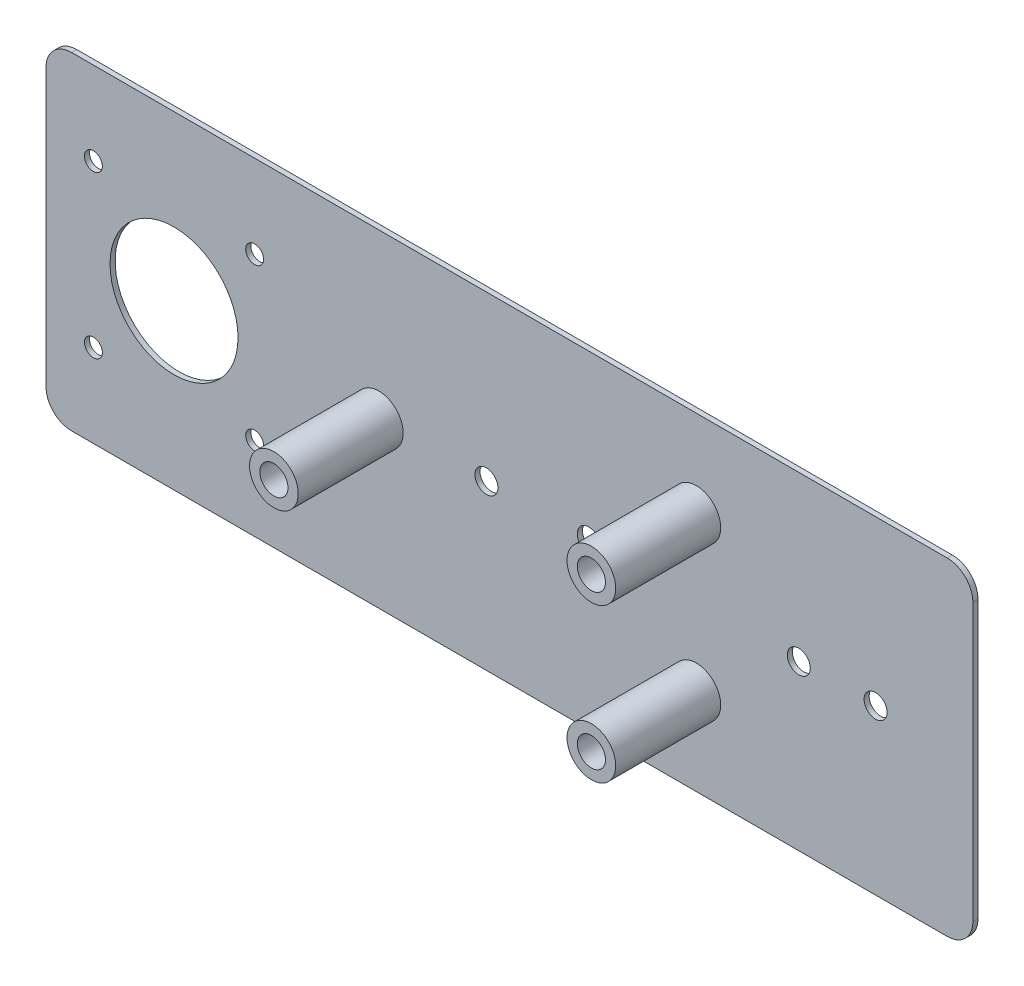
ISO-10303-21;
HEADER;
FILE_DESCRIPTION(('STEP AP214'),'2;1');
FILE_NAME('part.step','',(''),(''),'','','');
FILE_SCHEMA(('AUTOMOTIVE_DESIGN { 1 0 10303 214 1 1 1 1 }'));
ENDSEC;
DATA;
#1=APPLICATION_CONTEXT('core data for automotive mechanical design processes');
#2=APPLICATION_PROTOCOL_DEFINITION('international standard','automotive_design',2000,#1);
#3=PRODUCT_CONTEXT('',#1,'mechanical');
#4=PRODUCT('Part','Part','',(#3));
#5=PRODUCT_RELATED_PRODUCT_CATEGORY('part','',(#4));
#6=PRODUCT_DEFINITION_FORMATION('','',#4);
#7=PRODUCT_DEFINITION_CONTEXT('part definition',#1,'design');
#8=PRODUCT_DEFINITION('design','',#6,#7);
#9=PRODUCT_DEFINITION_SHAPE('','',#8);
#10=(LENGTH_UNIT() NAMED_UNIT(*) SI_UNIT(.MILLI.,.METRE.));
#11=(NAMED_UNIT(*) PLANE_ANGLE_UNIT() SI_UNIT($,.RADIAN.));
#12=(NAMED_UNIT(*) SI_UNIT($,.STERADIAN.) SOLID_ANGLE_UNIT());
#13=UNCERTAINTY_MEASURE_WITH_UNIT(LENGTH_MEASURE(1.E-05),#10,'distance_accuracy_value','');
#14=(GEOMETRIC_REPRESENTATION_CONTEXT(3) GLOBAL_UNCERTAINTY_ASSIGNED_CONTEXT((#13)) GLOBAL_UNIT_ASSIGNED_CONTEXT((#10,
#11,#12)) REPRESENTATION_CONTEXT('',''));
#15=CARTESIAN_POINT('',(0.,0.,0.));
#16=DIRECTION('',(0.,0.,1.));
#17=DIRECTION('',(1.,0.,0.));
#18=AXIS2_PLACEMENT_3D('',#15,#16,#17);
#19=CARTESIAN_POINT('',(-85.5,27.,1.));
#20=DIRECTION('',(0.,0.,-1.));
#21=DIRECTION('',(-1.,0.,0.));
#22=AXIS2_PLACEMENT_3D('',#19,#20,#21);
#23=PLANE('',#22);
#24=CARTESIAN_POINT('',(-25.5,0.,1.));
#25=DIRECTION('',(0.,0.,-1.));
#26=DIRECTION('',(-1.,0.,0.));
#27=AXIS2_PLACEMENT_3D('',#24,#25,#26);
#28=CIRCLE('',#27,4.75);
#29=CARTESIAN_POINT('',(-30.25,0.,1.));
#30=VERTEX_POINT('',#29);
#31=EDGE_CURVE('E143',#30,#30,#28,.F.);
#32=ORIENTED_EDGE('',*,*,#31,.F.);
#33=EDGE_LOOP('',(#32));
#34=FACE_BOUND('',#33,.T.);
#35=CARTESIAN_POINT('',(36.5,-15.,1.));
#36=DIRECTION('',(0.,0.,-1.));
#37=DIRECTION('',(-1.,0.,0.));
#38=AXIS2_PLACEMENT_3D('',#35,#36,#37);
#39=CIRCLE('',#38,4.75000000000001);
#40=CARTESIAN_POINT('',(31.75,-15.,1.));
#41=VERTEX_POINT('',#40);
#42=EDGE_CURVE('E46',#41,#41,#39,.F.);
#43=ORIENTED_EDGE('',*,*,#42,.F.);
#44=EDGE_LOOP('',(#43));
#45=FACE_BOUND('',#44,.T.);
#46=CARTESIAN_POINT('',(36.5,15.,1.));
#47=DIRECTION('',(0.,0.,-1.));
#48=DIRECTION('',(-1.,0.,0.));
#49=AXIS2_PLACEMENT_3D('',#46,#47,#48);
#50=CIRCLE('',#49,4.75);
#51=CARTESIAN_POINT('',(31.75,15.,1.));
#52=VERTEX_POINT('',#51);
#53=EDGE_CURVE('E11',#52,#52,#50,.F.);
#54=ORIENTED_EDGE('',*,*,#53,.F.);
#55=EDGE_LOOP('',(#54));
#56=FACE_BOUND('',#55,.T.);
#57=CARTESIAN_POINT('',(-85.5,-27.,1.));
#58=DIRECTION('',(0.,0.,-1.));
#59=DIRECTION('',(-1.,0.,0.));
#60=AXIS2_PLACEMENT_3D('',#57,#58,#59);
#61=CIRCLE('',#60,5.);
#62=CARTESIAN_POINT('',(-85.5,-32.,1.));
#63=VERTEX_POINT('',#62);
#64=CARTESIAN_POINT('',(-90.5,-27.,1.));
#65=VERTEX_POINT('',#64);
#66=EDGE_CURVE('E116',#63,#65,#61,.T.);
#67=ORIENTED_EDGE('',*,*,#66,.F.);
#68=DIRECTION('',(1.,0.,0.));
#69=VECTOR('',#68,1.);
#70=CARTESIAN_POINT('',(-14.5,-32.,1.));
#71=LINE('',#70,#69);
#72=CARTESIAN_POINT('',(85.5,-32.,1.));
#73=VERTEX_POINT('',#72);
#74=EDGE_CURVE('E172',#63,#73,#71,.T.);
#75=ORIENTED_EDGE('',*,*,#74,.T.);
#76=CARTESIAN_POINT('',(85.5,-27.,1.));
#77=DIRECTION('',(0.,0.,-1.));
#78=DIRECTION('',(-1.,0.,0.));
#79=AXIS2_PLACEMENT_3D('',#76,#77,#78);
#80=CIRCLE('',#79,5.00000000000001);
#81=CARTESIAN_POINT('',(90.5,-27.,1.));
#82=VERTEX_POINT('',#81);
#83=EDGE_CURVE('E267',#82,#73,#80,.T.);
#84=ORIENTED_EDGE('',*,*,#83,.F.);
#85=DIRECTION('',(0.,1.,0.));
#86=VECTOR('',#85,1.);
#87=CARTESIAN_POINT('',(90.5,32.,1.));
#88=LINE('',#87,#86);
#89=CARTESIAN_POINT('',(90.5,27.,1.));
#90=VERTEX_POINT('',#89);
#91=EDGE_CURVE('E125',#82,#90,#88,.T.);
#92=ORIENTED_EDGE('',*,*,#91,.T.);
#93=CARTESIAN_POINT('',(85.5,27.,1.));
#94=DIRECTION('',(0.,0.,-1.));
#95=DIRECTION('',(-1.,0.,0.));
#96=AXIS2_PLACEMENT_3D('',#93,#94,#95);
#97=CIRCLE('',#96,5.);
#98=CARTESIAN_POINT('',(85.5,32.,1.));
#99=VERTEX_POINT('',#98);
#100=EDGE_CURVE('E115',#99,#90,#97,.T.);
#101=ORIENTED_EDGE('',*,*,#100,.F.);
#102=DIRECTION('',(-1.,0.,0.));
#103=VECTOR('',#102,1.);
#104=CARTESIAN_POINT('',(-14.5,32.,1.));
#105=LINE('',#104,#103);
#106=CARTESIAN_POINT('',(-85.5,32.,1.));
#107=VERTEX_POINT('',#106);
#108=EDGE_CURVE('E111',#99,#107,#105,.T.);
#109=ORIENTED_EDGE('',*,*,#108,.T.);
#110=CARTESIAN_POINT('',(-85.5,27.,1.));
#111=DIRECTION('',(0.,0.,-1.));
#112=DIRECTION('',(-1.,0.,0.));
#113=AXIS2_PLACEMENT_3D('',#110,#111,#112);
#114=CIRCLE('',#113,5.);
#115=CARTESIAN_POINT('',(-90.5,27.,1.));
#116=VERTEX_POINT('',#115);
#117=EDGE_CURVE('E104',#116,#107,#114,.T.);
#118=ORIENTED_EDGE('',*,*,#117,.F.);
#119=DIRECTION('',(0.,-1.,0.));
#120=VECTOR('',#119,1.);
#121=CARTESIAN_POINT('',(-90.5,32.,1.));
#122=LINE('',#121,#120);
#123=EDGE_CURVE('E108',#116,#65,#122,.T.);
#124=ORIENTED_EDGE('',*,*,#123,.T.);
#125=EDGE_LOOP('',(#67,#75,#84,#92,#101,#109,#118,#124));
#126=FACE_BOUND('',#125,.T.);
#127=CARTESIAN_POINT('',(-4.50000000000001,0.,1.));
#128=DIRECTION('',(0.,0.,-1.));
#129=DIRECTION('',(-1.,0.,0.));
#130=AXIS2_PLACEMENT_3D('',#127,#128,#129);
#131=CIRCLE('',#130,2.25);
#132=CARTESIAN_POINT('',(-6.75,0.,1.));
#133=VERTEX_POINT('',#132);
#134=EDGE_CURVE('E144',#133,#133,#131,.F.);
#135=ORIENTED_EDGE('',*,*,#134,.F.);
#136=EDGE_LOOP('',(#135));
#137=FACE_BOUND('',#136,.T.);
#138=CARTESIAN_POINT('',(15.5,0.,1.));
#139=DIRECTION('',(0.,0.,-1.));
#140=DIRECTION('',(-1.,0.,0.));
#141=AXIS2_PLACEMENT_3D('',#138,#139,#140);
#142=CIRCLE('',#141,2.25);
#143=CARTESIAN_POINT('',(13.25,0.,1.));
#144=VERTEX_POINT('',#143);
#145=EDGE_CURVE('E147',#144,#144,#142,.F.);
#146=ORIENTED_EDGE('',*,*,#145,.F.);
#147=EDGE_LOOP('',(#146));
#148=FACE_BOUND('',#147,.T.);
#149=CARTESIAN_POINT('',(-81.25,15.75,1.));
#150=DIRECTION('',(0.,0.,-1.));
#151=DIRECTION('',(-1.,0.,0.));
#152=AXIS2_PLACEMENT_3D('',#149,#150,#151);
#153=CIRCLE('',#152,1.75);
#154=CARTESIAN_POINT('',(-83.,15.75,1.));
#155=VERTEX_POINT('',#154);
#156=EDGE_CURVE('E201',#155,#155,#153,.F.);
#157=ORIENTED_EDGE('',*,*,#156,.F.);
#158=EDGE_LOOP('',(#157));
#159=FACE_BOUND('',#158,.T.);
#160=CARTESIAN_POINT('',(-49.75,-15.75,1.));
#161=DIRECTION('',(0.,0.,-1.));
#162=DIRECTION('',(-1.,0.,0.));
#163=AXIS2_PLACEMENT_3D('',#160,#161,#162);
#164=CIRCLE('',#163,1.75);
#165=CARTESIAN_POINT('',(-51.5,-15.75,1.));
#166=VERTEX_POINT('',#165);
#167=EDGE_CURVE('E195',#166,#166,#164,.F.);
#168=ORIENTED_EDGE('',*,*,#167,.F.);
#169=EDGE_LOOP('',(#168));
#170=FACE_BOUND('',#169,.T.);
#171=CARTESIAN_POINT('',(-49.75,15.75,1.));
#172=DIRECTION('',(0.,0.,-1.));
#173=DIRECTION('',(-1.,0.,0.));
#174=AXIS2_PLACEMENT_3D('',#171,#172,#173);
#175=CIRCLE('',#174,1.75);
#176=CARTESIAN_POINT('',(-51.5,15.75,1.));
#177=VERTEX_POINT('',#176);
#178=EDGE_CURVE('E189',#177,#177,#175,.F.);
#179=ORIENTED_EDGE('',*,*,#178,.F.);
#180=EDGE_LOOP('',(#179));
#181=FACE_BOUND('',#180,.T.);
#182=CARTESIAN_POINT('',(-81.25,-15.75,1.));
#183=DIRECTION('',(0.,0.,-1.));
#184=DIRECTION('',(-1.,0.,0.));
#185=AXIS2_PLACEMENT_3D('',#182,#183,#184);
#186=CIRCLE('',#185,1.75);
#187=CARTESIAN_POINT('',(-83.,-15.75,1.));
#188=VERTEX_POINT('',#187);
#189=EDGE_CURVE('E192',#188,#188,#186,.F.);
#190=ORIENTED_EDGE('',*,*,#189,.F.);
#191=EDGE_LOOP('',(#190));
#192=FACE_BOUND('',#191,.T.);
#193=CARTESIAN_POINT('',(-65.5,0.,1.));
#194=DIRECTION('',(0.,0.,-1.));
#195=DIRECTION('',(-1.,0.,0.));
#196=AXIS2_PLACEMENT_3D('',#193,#194,#195);
#197=CIRCLE('',#196,12.5);
#198=CARTESIAN_POINT('',(-78.,0.,1.));
#199=VERTEX_POINT('',#198);
#200=EDGE_CURVE('E198',#199,#199,#197,.F.);
#201=ORIENTED_EDGE('',*,*,#200,.F.);
#202=EDGE_LOOP('',(#201));
#203=FACE_BOUND('',#202,.T.);
#204=CARTESIAN_POINT('',(71.5,0.,1.));
#205=DIRECTION('',(0.,0.,-1.));
#206=DIRECTION('',(-1.,0.,0.));
#207=AXIS2_PLACEMENT_3D('',#204,#205,#206);
#208=CIRCLE('',#207,2.25);
#209=CARTESIAN_POINT('',(69.25,0.,1.));
#210=VERTEX_POINT('',#209);
#211=EDGE_CURVE('E183',#210,#210,#208,.F.);
#212=ORIENTED_EDGE('',*,*,#211,.F.);
#213=EDGE_LOOP('',(#212));
#214=FACE_BOUND('',#213,.T.);
#215=CARTESIAN_POINT('',(56.5,0.,1.));
#216=DIRECTION('',(0.,0.,-1.));
#217=DIRECTION('',(-1.,0.,0.));
#218=AXIS2_PLACEMENT_3D('',#215,#216,#217);
#219=CIRCLE('',#218,2.25);
#220=CARTESIAN_POINT('',(54.25,0.,1.));
#221=VERTEX_POINT('',#220);
#222=EDGE_CURVE('E186',#221,#221,#219,.F.);
#223=ORIENTED_EDGE('',*,*,#222,.F.);
#224=EDGE_LOOP('',(#223));
#225=FACE_BOUND('',#224,.T.);
#226=ADVANCED_FACE('F38',(#34,#45,#56,#126,#137,#148,#159,#170,#181,#192,#203,#214,#225),#23,.F.);
#227=CARTESIAN_POINT('',(85.5,-27.,37.));
#228=DIRECTION('',(0.,0.,-1.));
#229=DIRECTION('',(-1.,0.,0.));
#230=AXIS2_PLACEMENT_3D('',#227,#228,#229);
#231=CYLINDRICAL_SURFACE('',#230,5.00000000000001);
#232=DIRECTION('',(0.,0.,-1.));
#233=VECTOR('',#232,1.);
#234=CARTESIAN_POINT('',(90.5,-27.,37.));
#235=LINE('',#234,#233);
#236=CARTESIAN_POINT('',(90.5,-27.,0.));
#237=VERTEX_POINT('',#236);
#238=EDGE_CURVE('E141',#82,#237,#235,.T.);
#239=ORIENTED_EDGE('',*,*,#238,.F.);
#240=ORIENTED_EDGE('',*,*,#83,.T.);
#241=DIRECTION('',(0.,0.,-1.));
#242=VECTOR('',#241,1.);
#243=CARTESIAN_POINT('',(85.5,-32.,37.));
#244=LINE('',#243,#242);
#245=CARTESIAN_POINT('',(85.5,-32.,0.));
#246=VERTEX_POINT('',#245);
#247=EDGE_CURVE('E53',#73,#246,#244,.T.);
#248=ORIENTED_EDGE('',*,*,#247,.T.);
#249=CARTESIAN_POINT('',(85.5,-27.,0.));
#250=DIRECTION('',(0.,0.,1.));
#251=DIRECTION('',(1.,0.,0.));
#252=AXIS2_PLACEMENT_3D('',#249,#250,#251);
#253=CIRCLE('',#252,5.00000000000001);
#254=EDGE_CURVE('E240',#246,#237,#253,.T.);
#255=ORIENTED_EDGE('',*,*,#254,.T.);
#256=EDGE_LOOP('',(#239,#240,#248,#255));
#257=FACE_BOUND('',#256,.T.);
#258=ADVANCED_FACE('F40',(#257),#231,.T.);
#259=CARTESIAN_POINT('',(90.5,27.,37.));
#260=DIRECTION('',(-1.,0.,0.));
#261=DIRECTION('',(0.,-1.,0.));
#262=AXIS2_PLACEMENT_3D('',#259,#260,#261);
#263=PLANE('',#262);
#264=DIRECTION('',(0.,0.,-1.));
#265=VECTOR('',#264,1.);
#266=CARTESIAN_POINT('',(90.5,27.,37.));
#267=LINE('',#266,#265);
#268=CARTESIAN_POINT('',(90.5,27.,0.));
#269=VERTEX_POINT('',#268);
#270=EDGE_CURVE('E139',#90,#269,#267,.T.);
#271=ORIENTED_EDGE('',*,*,#270,.F.);
#272=ORIENTED_EDGE('',*,*,#91,.F.);
#273=ORIENTED_EDGE('',*,*,#238,.T.);
#274=DIRECTION('',(0.,1.,0.));
#275=VECTOR('',#274,1.);
#276=CARTESIAN_POINT('',(90.5,27.,0.));
#277=LINE('',#276,#275);
#278=EDGE_CURVE('E242',#237,#269,#277,.T.);
#279=ORIENTED_EDGE('',*,*,#278,.T.);
#280=EDGE_LOOP('',(#271,#272,#273,#279));
#281=FACE_BOUND('',#280,.T.);
#282=ADVANCED_FACE('F271',(#281),#263,.F.);
#283=CARTESIAN_POINT('',(85.5,27.,37.));
#284=DIRECTION('',(0.,0.,-1.));
#285=DIRECTION('',(-1.,0.,0.));
#286=AXIS2_PLACEMENT_3D('',#283,#284,#285);
#287=CYLINDRICAL_SURFACE('',#286,5.);
#288=DIRECTION('',(0.,0.,-1.));
#289=VECTOR('',#288,1.);
#290=CARTESIAN_POINT('',(85.5,32.,37.));
#291=LINE('',#290,#289);
#292=CARTESIAN_POINT('',(85.5,32.,0.));
#293=VERTEX_POINT('',#292);
#294=EDGE_CURVE('E133',#99,#293,#291,.T.);
#295=ORIENTED_EDGE('',*,*,#294,.F.);
#296=ORIENTED_EDGE('',*,*,#100,.T.);
#297=ORIENTED_EDGE('',*,*,#270,.T.);
#298=CARTESIAN_POINT('',(85.5,27.,0.));
#299=DIRECTION('',(0.,0.,1.));
#300=DIRECTION('',(-1.,0.,0.));
#301=AXIS2_PLACEMENT_3D('',#298,#299,#300);
#302=CIRCLE('',#301,5.);
#303=EDGE_CURVE('E245',#269,#293,#302,.T.);
#304=ORIENTED_EDGE('',*,*,#303,.T.);
#305=EDGE_LOOP('',(#295,#296,#297,#304));
#306=FACE_BOUND('',#305,.T.);
#307=ADVANCED_FACE('F372',(#306),#287,.T.);
#308=CARTESIAN_POINT('',(-85.5,32.,37.));
#309=DIRECTION('',(0.,-1.,0.));
#310=DIRECTION('',(0.,0.,-1.));
#311=AXIS2_PLACEMENT_3D('',#308,#309,#310);
#312=PLANE('',#311);
#313=DIRECTION('',(0.,0.,-1.));
#314=VECTOR('',#313,1.);
#315=CARTESIAN_POINT('',(-85.5,32.,37.));
#316=LINE('',#315,#314);
#317=CARTESIAN_POINT('',(-85.5,32.,0.));
#318=VERTEX_POINT('',#317);
#319=EDGE_CURVE('E131',#107,#318,#316,.T.);
#320=ORIENTED_EDGE('',*,*,#319,.F.);
#321=ORIENTED_EDGE('',*,*,#108,.F.);
#322=ORIENTED_EDGE('',*,*,#294,.T.);
#323=DIRECTION('',(-1.,0.,0.));
#324=VECTOR('',#323,1.);
#325=CARTESIAN_POINT('',(-85.5,32.,0.));
#326=LINE('',#325,#324);
#327=EDGE_CURVE('E248',#293,#318,#326,.T.);
#328=ORIENTED_EDGE('',*,*,#327,.T.);
#329=EDGE_LOOP('',(#320,#321,#322,#328));
#330=FACE_BOUND('',#329,.T.);
#331=ADVANCED_FACE('F369',(#330),#312,.F.);
#332=CARTESIAN_POINT('',(-85.5,27.,37.));
#333=DIRECTION('',(0.,0.,-1.));
#334=DIRECTION('',(-1.,0.,0.));
#335=AXIS2_PLACEMENT_3D('',#332,#333,#334);
#336=CYLINDRICAL_SURFACE('',#335,5.);
#337=DIRECTION('',(0.,0.,-1.));
#338=VECTOR('',#337,1.);
#339=CARTESIAN_POINT('',(-90.5,27.,37.));
#340=LINE('',#339,#338);
#341=CARTESIAN_POINT('',(-90.5,27.,0.));
#342=VERTEX_POINT('',#341);
#343=EDGE_CURVE('E122',#116,#342,#340,.T.);
#344=ORIENTED_EDGE('',*,*,#343,.F.);
#345=ORIENTED_EDGE('',*,*,#117,.T.);
#346=ORIENTED_EDGE('',*,*,#319,.T.);
#347=CARTESIAN_POINT('',(-85.5,27.,0.));
#348=DIRECTION('',(0.,0.,1.));
#349=DIRECTION('',(1.,0.,0.));
#350=AXIS2_PLACEMENT_3D('',#347,#348,#349);
#351=CIRCLE('',#350,5.);
#352=EDGE_CURVE('E129',#318,#342,#351,.T.);
#353=ORIENTED_EDGE('',*,*,#352,.T.);
#354=EDGE_LOOP('',(#344,#345,#346,#353));
#355=FACE_BOUND('',#354,.T.);
#356=ADVANCED_FACE('F127',(#355),#336,.T.);
#357=CARTESIAN_POINT('',(-90.5,27.,37.));
#358=DIRECTION('',(1.,0.,0.));
#359=DIRECTION('',(0.,1.,0.));
#360=AXIS2_PLACEMENT_3D('',#357,#358,#359);
#361=PLANE('',#360);
#362=DIRECTION('',(0.,0.,-1.));
#363=VECTOR('',#362,1.);
#364=CARTESIAN_POINT('',(-90.5,-27.,37.));
#365=LINE('',#364,#363);
#366=CARTESIAN_POINT('',(-90.5,-27.,0.));
#367=VERTEX_POINT('',#366);
#368=EDGE_CURVE('E124',#65,#367,#365,.T.);
#369=ORIENTED_EDGE('',*,*,#368,.F.);
#370=ORIENTED_EDGE('',*,*,#123,.F.);
#371=ORIENTED_EDGE('',*,*,#343,.T.);
#372=DIRECTION('',(0.,-1.,0.));
#373=VECTOR('',#372,1.);
#374=CARTESIAN_POINT('',(-90.5,27.,0.));
#375=LINE('',#374,#373);
#376=EDGE_CURVE('E252',#342,#367,#375,.T.);
#377=ORIENTED_EDGE('',*,*,#376,.T.);
#378=EDGE_LOOP('',(#369,#370,#371,#377));
#379=FACE_BOUND('',#378,.T.);
#380=ADVANCED_FACE('F120',(#379),#361,.F.);
#381=CARTESIAN_POINT('',(-85.5,-27.,37.));
#382=DIRECTION('',(0.,0.,-1.));
#383=DIRECTION('',(-1.,0.,0.));
#384=AXIS2_PLACEMENT_3D('',#381,#382,#383);
#385=CYLINDRICAL_SURFACE('',#384,5.);
#386=DIRECTION('',(0.,0.,-1.));
#387=VECTOR('',#386,1.);
#388=CARTESIAN_POINT('',(-85.5,-32.,37.));
#389=LINE('',#388,#387);
#390=CARTESIAN_POINT('',(-85.5,-32.,0.));
#391=VERTEX_POINT('',#390);
#392=EDGE_CURVE('E60',#63,#391,#389,.T.);
#393=ORIENTED_EDGE('',*,*,#392,.F.);
#394=ORIENTED_EDGE('',*,*,#66,.T.);
#395=ORIENTED_EDGE('',*,*,#368,.T.);
#396=CARTESIAN_POINT('',(-85.5,-27.,0.));
#397=DIRECTION('',(0.,0.,1.));
#398=DIRECTION('',(1.,0.,0.));
#399=AXIS2_PLACEMENT_3D('',#396,#397,#398);
#400=CIRCLE('',#399,5.);
#401=EDGE_CURVE('E254',#367,#391,#400,.T.);
#402=ORIENTED_EDGE('',*,*,#401,.T.);
#403=EDGE_LOOP('',(#393,#394,#395,#402));
#404=FACE_BOUND('',#403,.T.);
#405=ADVANCED_FACE('F361',(#404),#385,.T.);
#406=CARTESIAN_POINT('',(-85.5,-32.,37.));
#407=DIRECTION('',(0.,1.,0.));
#408=DIRECTION('',(0.,0.,1.));
#409=AXIS2_PLACEMENT_3D('',#406,#407,#408);
#410=PLANE('',#409);
#411=ORIENTED_EDGE('',*,*,#74,.F.);
#412=ORIENTED_EDGE('',*,*,#392,.T.);
#413=DIRECTION('',(1.,0.,0.));
#414=VECTOR('',#413,1.);
#415=CARTESIAN_POINT('',(-85.5,-32.,0.));
#416=LINE('',#415,#414);
#417=EDGE_CURVE('E256',#391,#246,#416,.T.);
#418=ORIENTED_EDGE('',*,*,#417,.T.);
#419=ORIENTED_EDGE('',*,*,#247,.F.);
#420=EDGE_LOOP('',(#411,#412,#418,#419));
#421=FACE_BOUND('',#420,.T.);
#422=ADVANCED_FACE('F260',(#421),#410,.F.);
#423=CARTESIAN_POINT('',(85.5,-27.,0.));
#424=DIRECTION('',(0.,0.,1.));
#425=DIRECTION('',(1.,0.,0.));
#426=AXIS2_PLACEMENT_3D('',#423,#424,#425);
#427=PLANE('',#426);
#428=CARTESIAN_POINT('',(-4.50000000000001,0.,0.));
#429=DIRECTION('',(0.,0.,1.));
#430=DIRECTION('',(1.,0.,0.));
#431=AXIS2_PLACEMENT_3D('',#428,#429,#430);
#432=CIRCLE('',#431,2.25);
#433=CARTESIAN_POINT('',(-2.25000000000001,0.,0.));
#434=VERTEX_POINT('',#433);
#435=EDGE_CURVE('E205',#434,#434,#432,.T.);
#436=ORIENTED_EDGE('',*,*,#435,.T.);
#437=EDGE_LOOP('',(#436));
#438=FACE_BOUND('',#437,.T.);
#439=CARTESIAN_POINT('',(15.5,0.,0.));
#440=DIRECTION('',(0.,0.,1.));
#441=DIRECTION('',(1.,0.,0.));
#442=AXIS2_PLACEMENT_3D('',#439,#440,#441);
#443=CIRCLE('',#442,2.25);
#444=CARTESIAN_POINT('',(17.75,0.,0.));
#445=VERTEX_POINT('',#444);
#446=EDGE_CURVE('E204',#445,#445,#443,.T.);
#447=ORIENTED_EDGE('',*,*,#446,.T.);
#448=EDGE_LOOP('',(#447));
#449=FACE_BOUND('',#448,.T.);
#450=CARTESIAN_POINT('',(71.5,0.,0.));
#451=DIRECTION('',(0.,0.,1.));
#452=DIRECTION('',(1.,0.,0.));
#453=AXIS2_PLACEMENT_3D('',#450,#451,#452);
#454=CIRCLE('',#453,2.25);
#455=CARTESIAN_POINT('',(73.75,0.,0.));
#456=VERTEX_POINT('',#455);
#457=EDGE_CURVE('E208',#456,#456,#454,.T.);
#458=ORIENTED_EDGE('',*,*,#457,.T.);
#459=EDGE_LOOP('',(#458));
#460=FACE_BOUND('',#459,.T.);
#461=CARTESIAN_POINT('',(36.5,15.,0.));
#462=DIRECTION('',(0.,0.,1.));
#463=DIRECTION('',(1.,0.,0.));
#464=AXIS2_PLACEMENT_3D('',#461,#462,#463);
#465=CIRCLE('',#464,2.75);
#466=CARTESIAN_POINT('',(39.25,15.,0.));
#467=VERTEX_POINT('',#466);
#468=EDGE_CURVE('E218',#467,#467,#465,.T.);
#469=ORIENTED_EDGE('',*,*,#468,.T.);
#470=EDGE_LOOP('',(#469));
#471=FACE_BOUND('',#470,.T.);
#472=CARTESIAN_POINT('',(36.5,-15.,0.));
#473=DIRECTION('',(0.,0.,1.));
#474=DIRECTION('',(1.,0.,0.));
#475=AXIS2_PLACEMENT_3D('',#472,#473,#474);
#476=CIRCLE('',#475,2.75);
#477=CARTESIAN_POINT('',(39.25,-15.,0.));
#478=VERTEX_POINT('',#477);
#479=EDGE_CURVE('E228',#478,#478,#476,.T.);
#480=ORIENTED_EDGE('',*,*,#479,.T.);
#481=EDGE_LOOP('',(#480));
#482=FACE_BOUND('',#481,.T.);
#483=CARTESIAN_POINT('',(56.5,0.,0.));
#484=DIRECTION('',(0.,0.,1.));
#485=DIRECTION('',(1.,0.,0.));
#486=AXIS2_PLACEMENT_3D('',#483,#484,#485);
#487=CIRCLE('',#486,2.25);
#488=CARTESIAN_POINT('',(58.75,0.,0.));
#489=VERTEX_POINT('',#488);
#490=EDGE_CURVE('E225',#489,#489,#487,.T.);
#491=ORIENTED_EDGE('',*,*,#490,.T.);
#492=EDGE_LOOP('',(#491));
#493=FACE_BOUND('',#492,.T.);
#494=CARTESIAN_POINT('',(-25.5,0.,0.));
#495=DIRECTION('',(0.,0.,1.));
#496=DIRECTION('',(1.,0.,0.));
#497=AXIS2_PLACEMENT_3D('',#494,#495,#496);
#498=CIRCLE('',#497,2.75);
#499=CARTESIAN_POINT('',(-22.75,0.,0.));
#500=VERTEX_POINT('',#499);
#501=EDGE_CURVE('E229',#500,#500,#498,.T.);
#502=ORIENTED_EDGE('',*,*,#501,.T.);
#503=EDGE_LOOP('',(#502));
#504=FACE_BOUND('',#503,.T.);
#505=CARTESIAN_POINT('',(-49.75,15.75,0.));
#506=DIRECTION('',(0.,0.,1.));
#507=DIRECTION('',(1.,0.,0.));
#508=AXIS2_PLACEMENT_3D('',#505,#506,#507);
#509=CIRCLE('',#508,1.75);
#510=CARTESIAN_POINT('',(-48.,15.75,0.));
#511=VERTEX_POINT('',#510);
#512=EDGE_CURVE('E219',#511,#511,#509,.T.);
#513=ORIENTED_EDGE('',*,*,#512,.T.);
#514=EDGE_LOOP('',(#513));
#515=FACE_BOUND('',#514,.T.);
#516=CARTESIAN_POINT('',(-81.25,-15.75,0.));
#517=DIRECTION('',(0.,0.,1.));
#518=DIRECTION('',(1.,0.,0.));
#519=AXIS2_PLACEMENT_3D('',#516,#517,#518);
#520=CIRCLE('',#519,1.75);
#521=CARTESIAN_POINT('',(-79.5,-15.75,0.));
#522=VERTEX_POINT('',#521);
#523=EDGE_CURVE('E214',#522,#522,#520,.T.);
#524=ORIENTED_EDGE('',*,*,#523,.T.);
#525=EDGE_LOOP('',(#524));
#526=FACE_BOUND('',#525,.T.);
#527=CARTESIAN_POINT('',(-49.75,-15.75,0.));
#528=DIRECTION('',(0.,0.,1.));
#529=DIRECTION('',(1.,0.,0.));
#530=AXIS2_PLACEMENT_3D('',#527,#528,#529);
#531=CIRCLE('',#530,1.75);
#532=CARTESIAN_POINT('',(-48.,-15.75,0.));
#533=VERTEX_POINT('',#532);
#534=EDGE_CURVE('E211',#533,#533,#531,.T.);
#535=ORIENTED_EDGE('',*,*,#534,.T.);
#536=EDGE_LOOP('',(#535));
#537=FACE_BOUND('',#536,.T.);
#538=CARTESIAN_POINT('',(-65.5,0.,0.));
#539=DIRECTION('',(0.,0.,1.));
#540=DIRECTION('',(1.,0.,0.));
#541=AXIS2_PLACEMENT_3D('',#538,#539,#540);
#542=CIRCLE('',#541,12.5);
#543=CARTESIAN_POINT('',(-53.,0.,0.));
#544=VERTEX_POINT('',#543);
#545=EDGE_CURVE('E215',#544,#544,#542,.T.);
#546=ORIENTED_EDGE('',*,*,#545,.T.);
#547=EDGE_LOOP('',(#546));
#548=FACE_BOUND('',#547,.T.);
#549=CARTESIAN_POINT('',(-81.25,15.75,0.));
#550=DIRECTION('',(0.,0.,1.));
#551=DIRECTION('',(1.,0.,0.));
#552=AXIS2_PLACEMENT_3D('',#549,#550,#551);
#553=CIRCLE('',#552,1.75);
#554=CARTESIAN_POINT('',(-79.5,15.75,0.));
#555=VERTEX_POINT('',#554);
#556=EDGE_CURVE('E222',#555,#555,#553,.T.);
#557=ORIENTED_EDGE('',*,*,#556,.T.);
#558=EDGE_LOOP('',(#557));
#559=FACE_BOUND('',#558,.T.);
#560=ORIENTED_EDGE('',*,*,#254,.F.);
#561=ORIENTED_EDGE('',*,*,#417,.F.);
#562=ORIENTED_EDGE('',*,*,#401,.F.);
#563=ORIENTED_EDGE('',*,*,#376,.F.);
#564=ORIENTED_EDGE('',*,*,#352,.F.);
#565=ORIENTED_EDGE('',*,*,#327,.F.);
#566=ORIENTED_EDGE('',*,*,#303,.F.);
#567=ORIENTED_EDGE('',*,*,#278,.F.);
#568=EDGE_LOOP('',(#560,#561,#562,#563,#564,#565,#566,#567));
#569=FACE_BOUND('',#568,.T.);
#570=ADVANCED_FACE('F264',(#438,#449,#460,#471,#482,#493,#504,#515,#526,#537,#548,#559,#569),
#427,.F.);
#571=CARTESIAN_POINT('',(-81.25,15.75,0.));
#572=DIRECTION('',(0.,0.,1.));
#573=DIRECTION('',(1.,0.,0.));
#574=AXIS2_PLACEMENT_3D('',#571,#572,#573);
#575=CYLINDRICAL_SURFACE('',#574,1.75);
#576=ORIENTED_EDGE('',*,*,#156,.T.);
#577=EDGE_LOOP('',(#576));
#578=FACE_BOUND('',#577,.T.);
#579=ORIENTED_EDGE('',*,*,#556,.F.);
#580=EDGE_LOOP('',(#579));
#581=FACE_BOUND('',#580,.T.);
#582=ADVANCED_FACE('F326',(#578,#581),#575,.F.);
#583=CARTESIAN_POINT('',(-65.5,0.,0.));
#584=DIRECTION('',(0.,0.,1.));
#585=DIRECTION('',(1.,0.,0.));
#586=AXIS2_PLACEMENT_3D('',#583,#584,#585);
#587=CYLINDRICAL_SURFACE('',#586,12.5);
#588=ORIENTED_EDGE('',*,*,#200,.T.);
#589=EDGE_LOOP('',(#588));
#590=FACE_BOUND('',#589,.T.);
#591=ORIENTED_EDGE('',*,*,#545,.F.);
#592=EDGE_LOOP('',(#591));
#593=FACE_BOUND('',#592,.T.);
#594=ADVANCED_FACE('F322',(#590,#593),#587,.F.);
#595=CARTESIAN_POINT('',(-49.75,-15.75,0.));
#596=DIRECTION('',(0.,0.,1.));
#597=DIRECTION('',(1.,0.,0.));
#598=AXIS2_PLACEMENT_3D('',#595,#596,#597);
#599=CYLINDRICAL_SURFACE('',#598,1.75);
#600=ORIENTED_EDGE('',*,*,#167,.T.);
#601=EDGE_LOOP('',(#600));
#602=FACE_BOUND('',#601,.T.);
#603=ORIENTED_EDGE('',*,*,#534,.F.);
#604=EDGE_LOOP('',(#603));
#605=FACE_BOUND('',#604,.T.);
#606=ADVANCED_FACE('F318',(#602,#605),#599,.F.);
#607=CARTESIAN_POINT('',(-81.25,-15.75,0.));
#608=DIRECTION('',(0.,0.,1.));
#609=DIRECTION('',(1.,0.,0.));
#610=AXIS2_PLACEMENT_3D('',#607,#608,#609);
#611=CYLINDRICAL_SURFACE('',#610,1.75);
#612=ORIENTED_EDGE('',*,*,#189,.T.);
#613=EDGE_LOOP('',(#612));
#614=FACE_BOUND('',#613,.T.);
#615=ORIENTED_EDGE('',*,*,#523,.F.);
#616=EDGE_LOOP('',(#615));
#617=FACE_BOUND('',#616,.T.);
#618=ADVANCED_FACE('F321',(#614,#617),#611,.F.);
#619=CARTESIAN_POINT('',(-49.75,15.75,0.));
#620=DIRECTION('',(0.,0.,1.));
#621=DIRECTION('',(1.,0.,0.));
#622=AXIS2_PLACEMENT_3D('',#619,#620,#621);
#623=CYLINDRICAL_SURFACE('',#622,1.75);
#624=ORIENTED_EDGE('',*,*,#178,.T.);
#625=EDGE_LOOP('',(#624));
#626=FACE_BOUND('',#625,.T.);
#627=ORIENTED_EDGE('',*,*,#512,.F.);
#628=EDGE_LOOP('',(#627));
#629=FACE_BOUND('',#628,.T.);
#630=ADVANCED_FACE('F328',(#626,#629),#623,.F.);
#631=CARTESIAN_POINT('',(-25.5,0.,0.));
#632=DIRECTION('',(0.,0.,1.));
#633=DIRECTION('',(1.,0.,0.));
#634=AXIS2_PLACEMENT_3D('',#631,#632,#633);
#635=CYLINDRICAL_SURFACE('',#634,2.75);
#636=ORIENTED_EDGE('',*,*,#501,.F.);
#637=EDGE_LOOP('',(#636));
#638=FACE_BOUND('',#637,.T.);
#639=CARTESIAN_POINT('',(-25.5,0.,21.5));
#640=DIRECTION('',(0.,0.,1.));
#641=DIRECTION('',(1.,0.,0.));
#642=AXIS2_PLACEMENT_3D('',#639,#640,#641);
#643=CIRCLE('',#642,2.75);
#644=CARTESIAN_POINT('',(-22.75,0.,21.5));
#645=VERTEX_POINT('',#644);
#646=EDGE_CURVE('E282',#645,#645,#643,.T.);
#647=ORIENTED_EDGE('',*,*,#646,.T.);
#648=EDGE_LOOP('',(#647));
#649=FACE_BOUND('',#648,.T.);
#650=ADVANCED_FACE('F331',(#638,#649),#635,.F.);
#651=CARTESIAN_POINT('',(56.5,0.,0.));
#652=DIRECTION('',(0.,0.,1.));
#653=DIRECTION('',(1.,0.,0.));
#654=AXIS2_PLACEMENT_3D('',#651,#652,#653);
#655=CYLINDRICAL_SURFACE('',#654,2.25);
#656=ORIENTED_EDGE('',*,*,#222,.T.);
#657=EDGE_LOOP('',(#656));
#658=FACE_BOUND('',#657,.T.);
#659=ORIENTED_EDGE('',*,*,#490,.F.);
#660=EDGE_LOOP('',(#659));
#661=FACE_BOUND('',#660,.T.);
#662=ADVANCED_FACE('F336',(#658,#661),#655,.F.);
#663=CARTESIAN_POINT('',(36.5,-15.,0.));
#664=DIRECTION('',(0.,0.,1.));
#665=DIRECTION('',(1.,0.,0.));
#666=AXIS2_PLACEMENT_3D('',#663,#664,#665);
#667=CYLINDRICAL_SURFACE('',#666,2.75);
#668=ORIENTED_EDGE('',*,*,#479,.F.);
#669=EDGE_LOOP('',(#668));
#670=FACE_BOUND('',#669,.T.);
#671=CARTESIAN_POINT('',(36.5,-15.,21.5));
#672=DIRECTION('',(0.,0.,1.));
#673=DIRECTION('',(1.,0.,0.));
#674=AXIS2_PLACEMENT_3D('',#671,#672,#673);
#675=CIRCLE('',#674,2.75);
#676=CARTESIAN_POINT('',(39.25,-15.,21.5));
#677=VERTEX_POINT('',#676);
#678=EDGE_CURVE('E279',#677,#677,#675,.T.);
#679=ORIENTED_EDGE('',*,*,#678,.T.);
#680=EDGE_LOOP('',(#679));
#681=FACE_BOUND('',#680,.T.);
#682=ADVANCED_FACE('F339',(#670,#681),#667,.F.);
#683=CARTESIAN_POINT('',(36.5,15.,0.));
#684=DIRECTION('',(0.,0.,1.));
#685=DIRECTION('',(1.,0.,0.));
#686=AXIS2_PLACEMENT_3D('',#683,#684,#685);
#687=CYLINDRICAL_SURFACE('',#686,2.75);
#688=ORIENTED_EDGE('',*,*,#468,.F.);
#689=EDGE_LOOP('',(#688));
#690=FACE_BOUND('',#689,.T.);
#691=CARTESIAN_POINT('',(36.5,15.,21.5));
#692=DIRECTION('',(0.,0.,1.));
#693=DIRECTION('',(1.,0.,0.));
#694=AXIS2_PLACEMENT_3D('',#691,#692,#693);
#695=CIRCLE('',#694,2.75);
#696=CARTESIAN_POINT('',(39.25,15.,21.5));
#697=VERTEX_POINT('',#696);
#698=EDGE_CURVE('E278',#697,#697,#695,.T.);
#699=ORIENTED_EDGE('',*,*,#698,.T.);
#700=EDGE_LOOP('',(#699));
#701=FACE_BOUND('',#700,.T.);
#702=ADVANCED_FACE('F288',(#690,#701),#687,.F.);
#703=CARTESIAN_POINT('',(71.5,0.,0.));
#704=DIRECTION('',(0.,0.,1.));
#705=DIRECTION('',(1.,0.,0.));
#706=AXIS2_PLACEMENT_3D('',#703,#704,#705);
#707=CYLINDRICAL_SURFACE('',#706,2.25);
#708=ORIENTED_EDGE('',*,*,#211,.T.);
#709=EDGE_LOOP('',(#708));
#710=FACE_BOUND('',#709,.T.);
#711=ORIENTED_EDGE('',*,*,#457,.F.);
#712=EDGE_LOOP('',(#711));
#713=FACE_BOUND('',#712,.T.);
#714=ADVANCED_FACE('F316',(#710,#713),#707,.F.);
#715=CARTESIAN_POINT('',(15.5,0.,0.));
#716=DIRECTION('',(0.,0.,1.));
#717=DIRECTION('',(1.,0.,0.));
#718=AXIS2_PLACEMENT_3D('',#715,#716,#717);
#719=CYLINDRICAL_SURFACE('',#718,2.25);
#720=ORIENTED_EDGE('',*,*,#145,.T.);
#721=EDGE_LOOP('',(#720));
#722=FACE_BOUND('',#721,.T.);
#723=ORIENTED_EDGE('',*,*,#446,.F.);
#724=EDGE_LOOP('',(#723));
#725=FACE_BOUND('',#724,.T.);
#726=ADVANCED_FACE('F312',(#722,#725),#719,.F.);
#727=CARTESIAN_POINT('',(-4.50000000000001,0.,0.));
#728=DIRECTION('',(0.,0.,1.));
#729=DIRECTION('',(1.,0.,0.));
#730=AXIS2_PLACEMENT_3D('',#727,#728,#729);
#731=CYLINDRICAL_SURFACE('',#730,2.25);
#732=ORIENTED_EDGE('',*,*,#134,.T.);
#733=EDGE_LOOP('',(#732));
#734=FACE_BOUND('',#733,.T.);
#735=ORIENTED_EDGE('',*,*,#435,.F.);
#736=EDGE_LOOP('',(#735));
#737=FACE_BOUND('',#736,.T.);
#738=ADVANCED_FACE('F305',(#734,#737),#731,.F.);
#739=CARTESIAN_POINT('',(-25.5,0.,21.5));
#740=DIRECTION('',(0.,0.,1.));
#741=DIRECTION('',(1.,0.,0.));
#742=AXIS2_PLACEMENT_3D('',#739,#740,#741);
#743=PLANE('',#742);
#744=ORIENTED_EDGE('',*,*,#646,.F.);
#745=EDGE_LOOP('',(#744));
#746=FACE_BOUND('',#745,.T.);
#747=CARTESIAN_POINT('',(-25.5,0.,21.5));
#748=DIRECTION('',(0.,0.,1.));
#749=DIRECTION('',(1.,0.,0.));
#750=AXIS2_PLACEMENT_3D('',#747,#748,#749);
#751=CIRCLE('',#750,4.75);
#752=CARTESIAN_POINT('',(-20.75,0.,21.5));
#753=VERTEX_POINT('',#752);
#754=EDGE_CURVE('E148',#753,#753,#751,.T.);
#755=ORIENTED_EDGE('',*,*,#754,.T.);
#756=EDGE_LOOP('',(#755));
#757=FACE_BOUND('',#756,.T.);
#758=ADVANCED_FACE('F302',(#746,#757),#743,.T.);
#759=CARTESIAN_POINT('',(-25.5,0.,21.5));
#760=DIRECTION('',(0.,0.,-1.));
#761=DIRECTION('',(-1.,0.,0.));
#762=AXIS2_PLACEMENT_3D('',#759,#760,#761);
#763=CYLINDRICAL_SURFACE('',#762,4.75);
#764=ORIENTED_EDGE('',*,*,#31,.T.);
#765=EDGE_LOOP('',(#764));
#766=FACE_BOUND('',#765,.T.);
#767=ORIENTED_EDGE('',*,*,#754,.F.);
#768=EDGE_LOOP('',(#767));
#769=FACE_BOUND('',#768,.T.);
#770=ADVANCED_FACE('F300',(#766,#769),#763,.T.);
#771=CARTESIAN_POINT('',(36.5,-15.,21.5));
#772=DIRECTION('',(0.,0.,1.));
#773=DIRECTION('',(1.,0.,0.));
#774=AXIS2_PLACEMENT_3D('',#771,#772,#773);
#775=PLANE('',#774);
#776=ORIENTED_EDGE('',*,*,#678,.F.);
#777=EDGE_LOOP('',(#776));
#778=FACE_BOUND('',#777,.T.);
#779=CARTESIAN_POINT('',(36.5,-15.,21.5));
#780=DIRECTION('',(0.,0.,1.));
#781=DIRECTION('',(1.,0.,0.));
#782=AXIS2_PLACEMENT_3D('',#779,#780,#781);
#783=CIRCLE('',#782,4.75000000000001);
#784=CARTESIAN_POINT('',(41.25,-15.,21.5));
#785=VERTEX_POINT('',#784);
#786=EDGE_CURVE('E171',#785,#785,#783,.T.);
#787=ORIENTED_EDGE('',*,*,#786,.T.);
#788=EDGE_LOOP('',(#787));
#789=FACE_BOUND('',#788,.T.);
#790=ADVANCED_FACE('F295',(#778,#789),#775,.T.);
#791=CARTESIAN_POINT('',(36.5,-15.,21.5));
#792=DIRECTION('',(0.,0.,-1.));
#793=DIRECTION('',(-1.,0.,0.));
#794=AXIS2_PLACEMENT_3D('',#791,#792,#793);
#795=CYLINDRICAL_SURFACE('',#794,4.75000000000001);
#796=ORIENTED_EDGE('',*,*,#42,.T.);
#797=EDGE_LOOP('',(#796));
#798=FACE_BOUND('',#797,.T.);
#799=ORIENTED_EDGE('',*,*,#786,.F.);
#800=EDGE_LOOP('',(#799));
#801=FACE_BOUND('',#800,.T.);
#802=ADVANCED_FACE('F153',(#798,#801),#795,.T.);
#803=CARTESIAN_POINT('',(36.5,15.,21.5));
#804=DIRECTION('',(0.,0.,1.));
#805=DIRECTION('',(1.,0.,0.));
#806=AXIS2_PLACEMENT_3D('',#803,#804,#805);
#807=PLANE('',#806);
#808=ORIENTED_EDGE('',*,*,#698,.F.);
#809=EDGE_LOOP('',(#808));
#810=FACE_BOUND('',#809,.T.);
#811=CARTESIAN_POINT('',(36.5,15.,21.5));
#812=DIRECTION('',(0.,0.,1.));
#813=DIRECTION('',(1.,0.,0.));
#814=AXIS2_PLACEMENT_3D('',#811,#812,#813);
#815=CIRCLE('',#814,4.75);
#816=CARTESIAN_POINT('',(41.25,15.,21.5));
#817=VERTEX_POINT('',#816);
#818=EDGE_CURVE('E169',#817,#817,#815,.T.);
#819=ORIENTED_EDGE('',*,*,#818,.T.);
#820=EDGE_LOOP('',(#819));
#821=FACE_BOUND('',#820,.T.);
#822=ADVANCED_FACE('F165',(#810,#821),#807,.T.);
#823=CARTESIAN_POINT('',(36.5,15.,21.5));
#824=DIRECTION('',(0.,0.,-1.));
#825=DIRECTION('',(-1.,0.,0.));
#826=AXIS2_PLACEMENT_3D('',#823,#824,#825);
#827=CYLINDRICAL_SURFACE('',#826,4.75);
#828=ORIENTED_EDGE('',*,*,#53,.T.);
#829=EDGE_LOOP('',(#828));
#830=FACE_BOUND('',#829,.T.);
#831=ORIENTED_EDGE('',*,*,#818,.F.);
#832=EDGE_LOOP('',(#831));
#833=FACE_BOUND('',#832,.T.);
#834=ADVANCED_FACE('F162',(#830,#833),#827,.T.);
#835=CLOSED_SHELL('',(#226,#258,#282,#307,#331,#356,#380,#405,#422,#570,#582,#594,#606,#618,
#630,#650,#662,#682,#702,#714,#726,#738,#758,#770,#790,#802,#822,#834));
#836=MANIFOLD_SOLID_BREP('B2',#835);
#837=ADVANCED_BREP_SHAPE_REPRESENTATION('',(#18,#836),#14);
#838=SHAPE_DEFINITION_REPRESENTATION(#9,#837);
ENDSEC;
END-ISO-10303-21;
